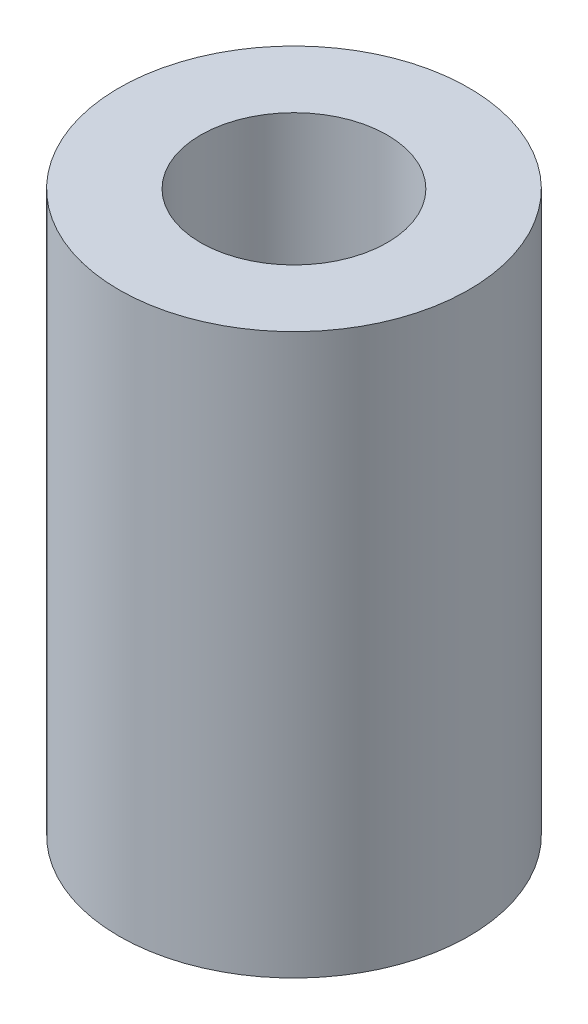
ISO-10303-21;
HEADER;
FILE_DESCRIPTION(('STEP AP214'),'2;1');
FILE_NAME('part.step','',(''),(''),'','','');
FILE_SCHEMA(('AUTOMOTIVE_DESIGN { 1 0 10303 214 1 1 1 1 }'));
ENDSEC;
DATA;
#1=APPLICATION_CONTEXT('core data for automotive mechanical design processes');
#2=APPLICATION_PROTOCOL_DEFINITION('international standard','automotive_design',2000,#1);
#3=PRODUCT_CONTEXT('',#1,'mechanical');
#4=PRODUCT('Part','Part','',(#3));
#5=PRODUCT_RELATED_PRODUCT_CATEGORY('part','',(#4));
#6=PRODUCT_DEFINITION_FORMATION('','',#4);
#7=PRODUCT_DEFINITION_CONTEXT('part definition',#1,'design');
#8=PRODUCT_DEFINITION('design','',#6,#7);
#9=PRODUCT_DEFINITION_SHAPE('','',#8);
#10=(LENGTH_UNIT() NAMED_UNIT(*) SI_UNIT(.MILLI.,.METRE.));
#11=(NAMED_UNIT(*) PLANE_ANGLE_UNIT() SI_UNIT($,.RADIAN.));
#12=(NAMED_UNIT(*) SI_UNIT($,.STERADIAN.) SOLID_ANGLE_UNIT());
#13=UNCERTAINTY_MEASURE_WITH_UNIT(LENGTH_MEASURE(1.E-05),#10,'distance_accuracy_value','');
#14=(GEOMETRIC_REPRESENTATION_CONTEXT(3) GLOBAL_UNCERTAINTY_ASSIGNED_CONTEXT((#13)) GLOBAL_UNIT_ASSIGNED_CONTEXT((#10,
#11,#12)) REPRESENTATION_CONTEXT('',''));
#15=CARTESIAN_POINT('',(0.,0.,0.));
#16=DIRECTION('',(0.,0.,1.));
#17=DIRECTION('',(1.,0.,0.));
#18=AXIS2_PLACEMENT_3D('',#15,#16,#17);
#19=CARTESIAN_POINT('',(0.,24.,0.));
#20=DIRECTION('',(0.,-1.,0.));
#21=DIRECTION('',(0.,0.,-1.));
#22=AXIS2_PLACEMENT_3D('',#19,#20,#21);
#23=CYLINDRICAL_SURFACE('',#22,7.5);
#24=CARTESIAN_POINT('',(0.,24.,0.));
#25=DIRECTION('',(0.,1.,0.));
#26=DIRECTION('',(0.,0.,1.));
#27=AXIS2_PLACEMENT_3D('',#24,#25,#26);
#28=CIRCLE('',#27,7.5);
#29=CARTESIAN_POINT('',(0.,24.,7.5));
#30=VERTEX_POINT('',#29);
#31=EDGE_CURVE('E10',#30,#30,#28,.T.);
#32=ORIENTED_EDGE('',*,*,#31,.F.);
#33=EDGE_LOOP('',(#32));
#34=FACE_BOUND('',#33,.T.);
#35=CARTESIAN_POINT('',(0.,0.,0.));
#36=DIRECTION('',(0.,1.,0.));
#37=DIRECTION('',(0.,0.,1.));
#38=AXIS2_PLACEMENT_3D('',#35,#36,#37);
#39=CIRCLE('',#38,7.5);
#40=CARTESIAN_POINT('',(0.,0.,7.5));
#41=VERTEX_POINT('',#40);
#42=EDGE_CURVE('E40',#41,#41,#39,.T.);
#43=ORIENTED_EDGE('',*,*,#42,.T.);
#44=EDGE_LOOP('',(#43));
#45=FACE_BOUND('',#44,.T.);
#46=ADVANCED_FACE('F37',(#34,#45),#23,.T.);
#47=CARTESIAN_POINT('',(0.,24.,0.));
#48=DIRECTION('',(0.,1.,0.));
#49=DIRECTION('',(0.,0.,1.));
#50=AXIS2_PLACEMENT_3D('',#47,#48,#49);
#51=PLANE('',#50);
#52=CARTESIAN_POINT('',(0.,24.,0.));
#53=DIRECTION('',(0.,1.,0.));
#54=DIRECTION('',(0.,0.,1.));
#55=AXIS2_PLACEMENT_3D('',#52,#53,#54);
#56=CIRCLE('',#55,4.);
#57=CARTESIAN_POINT('',(0.,24.,4.));
#58=VERTEX_POINT('',#57);
#59=EDGE_CURVE('E51',#58,#58,#56,.T.);
#60=ORIENTED_EDGE('',*,*,#59,.F.);
#61=EDGE_LOOP('',(#60));
#62=FACE_BOUND('',#61,.T.);
#63=ORIENTED_EDGE('',*,*,#31,.T.);
#64=EDGE_LOOP('',(#63));
#65=FACE_BOUND('',#64,.T.);
#66=ADVANCED_FACE('F68',(#62,#65),#51,.T.);
#67=CARTESIAN_POINT('',(0.,0.,0.));
#68=DIRECTION('',(0.,1.,0.));
#69=DIRECTION('',(0.,0.,1.));
#70=AXIS2_PLACEMENT_3D('',#67,#68,#69);
#71=PLANE('',#70);
#72=CARTESIAN_POINT('',(0.,0.,0.));
#73=DIRECTION('',(0.,1.,0.));
#74=DIRECTION('',(0.,0.,1.));
#75=AXIS2_PLACEMENT_3D('',#72,#73,#74);
#76=CIRCLE('',#75,4.);
#77=CARTESIAN_POINT('',(0.,0.,4.));
#78=VERTEX_POINT('',#77);
#79=EDGE_CURVE('E49',#78,#78,#76,.T.);
#80=ORIENTED_EDGE('',*,*,#79,.T.);
#81=EDGE_LOOP('',(#80));
#82=FACE_BOUND('',#81,.T.);
#83=ORIENTED_EDGE('',*,*,#42,.F.);
#84=EDGE_LOOP('',(#83));
#85=FACE_BOUND('',#84,.T.);
#86=ADVANCED_FACE('F59',(#82,#85),#71,.F.);
#87=CARTESIAN_POINT('',(0.,0.,0.));
#88=DIRECTION('',(0.,1.,0.));
#89=DIRECTION('',(0.,0.,1.));
#90=AXIS2_PLACEMENT_3D('',#87,#88,#89);
#91=CYLINDRICAL_SURFACE('',#90,4.);
#92=ORIENTED_EDGE('',*,*,#79,.F.);
#93=EDGE_LOOP('',(#92));
#94=FACE_BOUND('',#93,.T.);
#95=ORIENTED_EDGE('',*,*,#59,.T.);
#96=EDGE_LOOP('',(#95));
#97=FACE_BOUND('',#96,.T.);
#98=ADVANCED_FACE('F62',(#94,#97),#91,.F.);
#99=CLOSED_SHELL('',(#46,#66,#86,#98));
#100=MANIFOLD_SOLID_BREP('B2',#99);
#101=ADVANCED_BREP_SHAPE_REPRESENTATION('',(#18,#100),#14);
#102=SHAPE_DEFINITION_REPRESENTATION(#9,#101);
ENDSEC;
END-ISO-10303-21;
